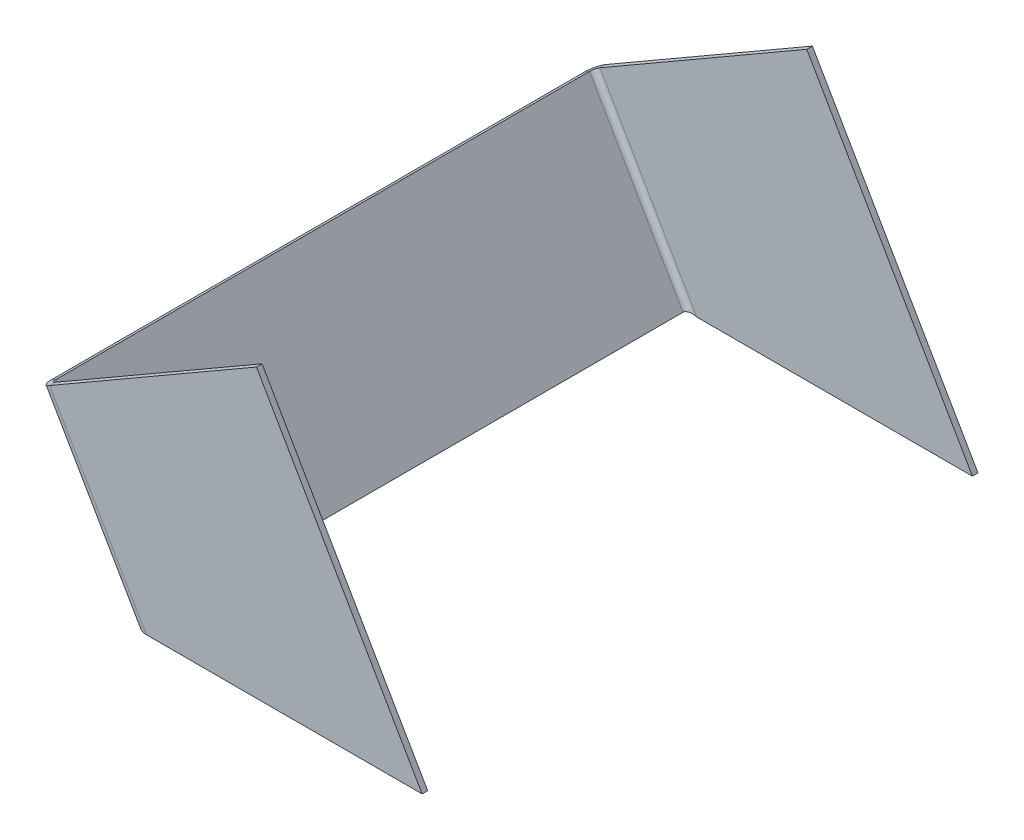
ISO-10303-21;
HEADER;
FILE_DESCRIPTION(('STEP AP214'),'2;1');
FILE_NAME('part.step','',(''),(''),'','','');
FILE_SCHEMA(('AUTOMOTIVE_DESIGN { 1 0 10303 214 1 1 1 1 }'));
ENDSEC;
DATA;
#1=APPLICATION_CONTEXT('core data for automotive mechanical design processes');
#2=APPLICATION_PROTOCOL_DEFINITION('international standard','automotive_design',2000,#1);
#3=PRODUCT_CONTEXT('',#1,'mechanical');
#4=PRODUCT('Part','Part','',(#3));
#5=PRODUCT_RELATED_PRODUCT_CATEGORY('part','',(#4));
#6=PRODUCT_DEFINITION_FORMATION('','',#4);
#7=PRODUCT_DEFINITION_CONTEXT('part definition',#1,'design');
#8=PRODUCT_DEFINITION('design','',#6,#7);
#9=PRODUCT_DEFINITION_SHAPE('','',#8);
#10=(LENGTH_UNIT() NAMED_UNIT(*) SI_UNIT(.MILLI.,.METRE.));
#11=(NAMED_UNIT(*) PLANE_ANGLE_UNIT() SI_UNIT($,.RADIAN.));
#12=(NAMED_UNIT(*) SI_UNIT($,.STERADIAN.) SOLID_ANGLE_UNIT());
#13=UNCERTAINTY_MEASURE_WITH_UNIT(LENGTH_MEASURE(1.E-05),#10,'distance_accuracy_value','');
#14=(GEOMETRIC_REPRESENTATION_CONTEXT(3) GLOBAL_UNCERTAINTY_ASSIGNED_CONTEXT((#13)) GLOBAL_UNIT_ASSIGNED_CONTEXT((#10,
#11,#12)) REPRESENTATION_CONTEXT('',''));
#15=CARTESIAN_POINT('',(0.,0.,0.));
#16=DIRECTION('',(0.,0.,1.));
#17=DIRECTION('',(1.,0.,0.));
#18=AXIS2_PLACEMENT_3D('',#15,#16,#17);
#19=CARTESIAN_POINT('',(-479.416697508023,3129.49491924311,-97.5));
#20=DIRECTION('',(0.866025403784441,0.499999999999996,0.));
#21=DIRECTION('',(-0.499999999999996,0.866025403784441,0.));
#22=AXIS2_PLACEMENT_3D('',#19,#20,#21);
#23=PLANE('',#22);
#24=DIRECTION('',(0.,0.,1.));
#25=VECTOR('',#24,1.);
#26=CARTESIAN_POINT('',(-520.122824862242,3199.99999999999,-97.5));
#27=LINE('',#26,#25);
#28=CARTESIAN_POINT('',(-520.122824862242,3199.99999999999,-99.5));
#29=VERTEX_POINT('',#28);
#30=CARTESIAN_POINT('',(-520.122824862242,3199.99999999999,-97.5));
#31=VERTEX_POINT('',#30);
#32=EDGE_CURVE('E11',#29,#31,#27,.T.);
#33=ORIENTED_EDGE('',*,*,#32,.F.);
#34=DIRECTION('',(-0.499999999999996,0.866025403784441,0.));
#35=VECTOR('',#34,1.);
#36=CARTESIAN_POINT('',(-479.416697508023,3129.49491924311,-99.5));
#37=LINE('',#36,#35);
#38=CARTESIAN_POINT('',(-579.416697508021,3302.7,-99.5));
#39=VERTEX_POINT('',#38);
#40=EDGE_CURVE('E134',#29,#39,#37,.T.);
#41=ORIENTED_EDGE('',*,*,#40,.T.);
#42=DIRECTION('',(0.,0.,1.));
#43=VECTOR('',#42,1.);
#44=CARTESIAN_POINT('',(-579.416697508021,3302.7,-97.5));
#45=LINE('',#44,#43);
#46=CARTESIAN_POINT('',(-579.416697508021,3302.7,-97.5));
#47=VERTEX_POINT('',#46);
#48=EDGE_CURVE('E50',#39,#47,#45,.T.);
#49=ORIENTED_EDGE('',*,*,#48,.T.);
#50=DIRECTION('',(-0.499999999999996,0.866025403784441,0.));
#51=VECTOR('',#50,1.);
#52=CARTESIAN_POINT('',(-479.416697508023,3129.49491924311,-97.5));
#53=LINE('',#52,#51);
#54=EDGE_CURVE('E195',#31,#47,#53,.T.);
#55=ORIENTED_EDGE('',*,*,#54,.F.);
#56=EDGE_LOOP('',(#33,#41,#49,#55));
#57=FACE_BOUND('',#56,.T.);
#58=ADVANCED_FACE('F40',(#57),#23,.T.);
#59=CARTESIAN_POINT('',(-579.416697508021,3302.7,-97.5));
#60=DIRECTION('',(-0.499999999999997,0.866025403784441,0.));
#61=DIRECTION('',(-0.866025403784441,-0.499999999999997,0.));
#62=AXIS2_PLACEMENT_3D('',#59,#60,#61);
#63=PLANE('',#62);
#64=ORIENTED_EDGE('',*,*,#48,.F.);
#65=DIRECTION('',(-0.866025403784441,-0.499999999999997,0.));
#66=VECTOR('',#65,1.);
#67=CARTESIAN_POINT('',(-579.416697508021,3302.7,-99.5));
#68=LINE('',#67,#66);
#69=CARTESIAN_POINT('',(-653.461869531591,3259.95,-99.5));
#70=VERTEX_POINT('',#69);
#71=EDGE_CURVE('E139',#39,#70,#68,.T.);
#72=ORIENTED_EDGE('',*,*,#71,.T.);
#73=DIRECTION('',(0.,0.,1.));
#74=VECTOR('',#73,1.);
#75=CARTESIAN_POINT('',(-653.461869531591,3259.95,-97.5));
#76=LINE('',#75,#74);
#77=CARTESIAN_POINT('',(-653.461869531591,3259.95,-97.5));
#78=VERTEX_POINT('',#77);
#79=EDGE_CURVE('E58',#70,#78,#76,.T.);
#80=ORIENTED_EDGE('',*,*,#79,.T.);
#81=DIRECTION('',(-0.866025403784441,-0.499999999999997,0.));
#82=VECTOR('',#81,1.);
#83=CARTESIAN_POINT('',(-579.416697508021,3302.7,-97.5));
#84=LINE('',#83,#82);
#85=EDGE_CURVE('E198',#47,#78,#84,.T.);
#86=ORIENTED_EDGE('',*,*,#85,.F.);
#87=EDGE_LOOP('',(#64,#72,#80,#86));
#88=FACE_BOUND('',#87,.T.);
#89=ADVANCED_FACE('F201',(#88),#63,.T.);
#90=CARTESIAN_POINT('',(-653.461869531591,3259.95,-95.5));
#91=DIRECTION('',(-0.499999999999997,0.866025403784441,0.));
#92=DIRECTION('',(-0.866025403784441,-0.499999999999997,0.));
#93=AXIS2_PLACEMENT_3D('',#90,#91,#92);
#94=PLANE('',#93);
#95=ORIENTED_EDGE('',*,*,#79,.F.);
#96=CARTESIAN_POINT('',(-653.461869531591,3259.95,-95.5));
#97=DIRECTION('',(-0.499999999999996,0.866025403784441,0.));
#98=DIRECTION('',(-0.866025403784441,-0.499999999999996,0.));
#99=AXIS2_PLACEMENT_3D('',#96,#97,#98);
#100=CIRCLE('',#99,4.);
#101=CARTESIAN_POINT('',(-656.925971146729,3257.95,-95.5));
#102=VERTEX_POINT('',#101);
#103=EDGE_CURVE('E128',#70,#102,#100,.T.);
#104=ORIENTED_EDGE('',*,*,#103,.T.);
#105=DIRECTION('',(0.866025403784441,0.499999999999996,0.));
#106=VECTOR('',#105,1.);
#107=CARTESIAN_POINT('',(-655.193920339161,3258.95,-95.5));
#108=LINE('',#107,#106);
#109=CARTESIAN_POINT('',(-655.193920339161,3258.95,-95.5));
#110=VERTEX_POINT('',#109);
#111=EDGE_CURVE('E190',#102,#110,#108,.T.);
#112=ORIENTED_EDGE('',*,*,#111,.T.);
#113=CARTESIAN_POINT('',(-653.461869531591,3259.95,-95.5));
#114=DIRECTION('',(0.499999999999997,-0.866025403784441,0.));
#115=DIRECTION('',(-0.866025403784441,-0.499999999999997,0.));
#116=AXIS2_PLACEMENT_3D('',#113,#114,#115);
#117=CIRCLE('',#116,2.);
#118=EDGE_CURVE('E117',#78,#110,#117,.F.);
#119=ORIENTED_EDGE('',*,*,#118,.F.);
#120=EDGE_LOOP('',(#95,#104,#112,#119));
#121=FACE_BOUND('',#120,.T.);
#122=ADVANCED_FACE('F230',(#121),#94,.T.);
#123=CARTESIAN_POINT('',(-655.193920339161,3258.95,-99.5));
#124=DIRECTION('',(0.499999999999996,-0.866025403784441,0.));
#125=DIRECTION('',(0.,0.,-1.));
#126=AXIS2_PLACEMENT_3D('',#123,#124,#125);
#127=PLANE('',#126);
#128=ORIENTED_EDGE('',*,*,#111,.F.);
#129=DIRECTION('',(0.,0.,-1.));
#130=VECTOR('',#129,1.);
#131=CARTESIAN_POINT('',(-656.925971146729,3257.95,-99.5));
#132=LINE('',#131,#130);
#133=CARTESIAN_POINT('',(-656.925971146729,3257.95,95.5));
#134=VERTEX_POINT('',#133);
#135=EDGE_CURVE('E156',#102,#134,#132,.F.);
#136=ORIENTED_EDGE('',*,*,#135,.T.);
#137=DIRECTION('',(0.86602540378443,0.500000000000015,0.));
#138=VECTOR('',#137,1.);
#139=CARTESIAN_POINT('',(-655.193920339161,3258.95,95.5));
#140=LINE('',#139,#138);
#141=CARTESIAN_POINT('',(-655.193920339161,3258.95,95.5));
#142=VERTEX_POINT('',#141);
#143=EDGE_CURVE('E187',#134,#142,#140,.T.);
#144=ORIENTED_EDGE('',*,*,#143,.T.);
#145=DIRECTION('',(0.,0.,-1.));
#146=VECTOR('',#145,1.);
#147=CARTESIAN_POINT('',(-655.193920339161,3258.95,-99.5));
#148=LINE('',#147,#146);
#149=EDGE_CURVE('E228',#110,#142,#148,.F.);
#150=ORIENTED_EDGE('',*,*,#149,.F.);
#151=EDGE_LOOP('',(#128,#136,#144,#150));
#152=FACE_BOUND('',#151,.T.);
#153=ADVANCED_FACE('F223',(#152),#127,.F.);
#154=CARTESIAN_POINT('',(-653.461869531591,3259.95,95.5));
#155=DIRECTION('',(-0.499999999999997,0.866025403784441,0.));
#156=DIRECTION('',(-0.866025403784441,-0.499999999999997,0.));
#157=AXIS2_PLACEMENT_3D('',#154,#155,#156);
#158=PLANE('',#157);
#159=ORIENTED_EDGE('',*,*,#143,.F.);
#160=CARTESIAN_POINT('',(-653.461869531591,3259.95,95.5));
#161=DIRECTION('',(-0.499999999999996,0.866025403784441,0.));
#162=DIRECTION('',(-0.866025403784441,-0.499999999999996,0.));
#163=AXIS2_PLACEMENT_3D('',#160,#161,#162);
#164=CIRCLE('',#163,4.);
#165=CARTESIAN_POINT('',(-653.461869531591,3259.95,99.5));
#166=VERTEX_POINT('',#165);
#167=EDGE_CURVE('E131',#134,#166,#164,.T.);
#168=ORIENTED_EDGE('',*,*,#167,.T.);
#169=DIRECTION('',(0.,0.,-1.));
#170=VECTOR('',#169,1.);
#171=CARTESIAN_POINT('',(-653.461869531591,3259.95,97.5));
#172=LINE('',#171,#170);
#173=CARTESIAN_POINT('',(-653.461869531591,3259.95,97.5));
#174=VERTEX_POINT('',#173);
#175=EDGE_CURVE('E184',#166,#174,#172,.T.);
#176=ORIENTED_EDGE('',*,*,#175,.T.);
#177=CARTESIAN_POINT('',(-653.461869531591,3259.95,95.5));
#178=DIRECTION('',(0.499999999999997,-0.866025403784441,0.));
#179=DIRECTION('',(-0.866025403784441,-0.499999999999997,0.));
#180=AXIS2_PLACEMENT_3D('',#177,#178,#179);
#181=CIRCLE('',#180,2.);
#182=EDGE_CURVE('E282',#142,#174,#181,.F.);
#183=ORIENTED_EDGE('',*,*,#182,.F.);
#184=EDGE_LOOP('',(#159,#168,#176,#183));
#185=FACE_BOUND('',#184,.T.);
#186=ADVANCED_FACE('F324',(#185),#158,.T.);
#187=CARTESIAN_POINT('',(-656.925971146729,3257.95,97.5));
#188=DIRECTION('',(0.499999999999997,-0.866025403784441,0.));
#189=DIRECTION('',(-0.866025403784441,-0.499999999999997,0.));
#190=AXIS2_PLACEMENT_3D('',#187,#188,#189);
#191=PLANE('',#190);
#192=ORIENTED_EDGE('',*,*,#175,.F.);
#193=DIRECTION('',(-0.866025403784441,-0.499999999999997,0.));
#194=VECTOR('',#193,1.);
#195=CARTESIAN_POINT('',(-656.925971146729,3257.95,99.5));
#196=LINE('',#195,#194);
#197=CARTESIAN_POINT('',(-579.416697508021,3302.7,99.5));
#198=VERTEX_POINT('',#197);
#199=EDGE_CURVE('E163',#166,#198,#196,.F.);
#200=ORIENTED_EDGE('',*,*,#199,.T.);
#201=DIRECTION('',(0.,0.,-1.));
#202=VECTOR('',#201,1.);
#203=CARTESIAN_POINT('',(-579.416697508021,3302.7,97.5));
#204=LINE('',#203,#202);
#205=CARTESIAN_POINT('',(-579.416697508021,3302.7,97.5));
#206=VERTEX_POINT('',#205);
#207=EDGE_CURVE('E181',#198,#206,#204,.T.);
#208=ORIENTED_EDGE('',*,*,#207,.T.);
#209=DIRECTION('',(-0.866025403784441,-0.499999999999997,0.));
#210=VECTOR('',#209,1.);
#211=CARTESIAN_POINT('',(-656.925971146729,3257.95,97.5));
#212=LINE('',#211,#210);
#213=EDGE_CURVE('E262',#174,#206,#212,.F.);
#214=ORIENTED_EDGE('',*,*,#213,.F.);
#215=EDGE_LOOP('',(#192,#200,#208,#214));
#216=FACE_BOUND('',#215,.T.);
#217=ADVANCED_FACE('F303',(#216),#191,.F.);
#218=CARTESIAN_POINT('',(-479.416697508023,3129.49491924311,97.5));
#219=DIRECTION('',(-0.866025403784441,-0.499999999999996,0.));
#220=DIRECTION('',(-0.499999999999996,0.866025403784441,0.));
#221=AXIS2_PLACEMENT_3D('',#218,#219,#220);
#222=PLANE('',#221);
#223=ORIENTED_EDGE('',*,*,#207,.F.);
#224=DIRECTION('',(-0.499999999999996,0.866025403784441,0.));
#225=VECTOR('',#224,1.);
#226=CARTESIAN_POINT('',(-479.416697508023,3129.49491924311,99.5));
#227=LINE('',#226,#225);
#228=CARTESIAN_POINT('',(-520.122824862242,3199.99999999999,99.5));
#229=VERTEX_POINT('',#228);
#230=EDGE_CURVE('E160',#229,#198,#227,.T.);
#231=ORIENTED_EDGE('',*,*,#230,.F.);
#232=DIRECTION('',(0.,0.,-1.));
#233=VECTOR('',#232,1.);
#234=CARTESIAN_POINT('',(-520.122824862242,3199.99999999999,97.5));
#235=LINE('',#234,#233);
#236=CARTESIAN_POINT('',(-520.122824862242,3199.99999999999,97.5));
#237=VERTEX_POINT('',#236);
#238=EDGE_CURVE('E178',#229,#237,#235,.T.);
#239=ORIENTED_EDGE('',*,*,#238,.T.);
#240=DIRECTION('',(-0.499999999999996,0.866025403784441,0.));
#241=VECTOR('',#240,1.);
#242=CARTESIAN_POINT('',(-479.416697508023,3129.49491924311,97.5));
#243=LINE('',#242,#241);
#244=EDGE_CURVE('E141',#237,#206,#243,.T.);
#245=ORIENTED_EDGE('',*,*,#244,.T.);
#246=EDGE_LOOP('',(#223,#231,#239,#245));
#247=FACE_BOUND('',#246,.T.);
#248=ADVANCED_FACE('F250',(#247),#222,.F.);
#249=CARTESIAN_POINT('',(-637.996865734336,3199.99999999999,97.5));
#250=DIRECTION('',(0.,-1.,0.));
#251=DIRECTION('',(-1.,0.,0.));
#252=AXIS2_PLACEMENT_3D('',#249,#250,#251);
#253=PLANE('',#252);
#254=ORIENTED_EDGE('',*,*,#238,.F.);
#255=DIRECTION('',(-1.,0.,0.));
#256=VECTOR('',#255,1.);
#257=CARTESIAN_POINT('',(-637.996865734336,3199.99999999999,99.5));
#258=LINE('',#257,#256);
#259=CARTESIAN_POINT('',(-618.849720893668,3199.99999999999,99.5));
#260=VERTEX_POINT('',#259);
#261=EDGE_CURVE('E157',#229,#260,#258,.T.);
#262=ORIENTED_EDGE('',*,*,#261,.T.);
#263=DIRECTION('',(0.,0.,-1.));
#264=VECTOR('',#263,1.);
#265=CARTESIAN_POINT('',(-618.849720893668,3199.99999999999,97.5));
#266=LINE('',#265,#264);
#267=CARTESIAN_POINT('',(-618.849720893668,3199.99999999999,97.5));
#268=VERTEX_POINT('',#267);
#269=EDGE_CURVE('E175',#260,#268,#266,.T.);
#270=ORIENTED_EDGE('',*,*,#269,.T.);
#271=DIRECTION('',(-1.,0.,0.));
#272=VECTOR('',#271,1.);
#273=CARTESIAN_POINT('',(-637.996865734336,3199.99999999999,97.5));
#274=LINE('',#273,#272);
#275=EDGE_CURVE('E259',#237,#268,#274,.T.);
#276=ORIENTED_EDGE('',*,*,#275,.F.);
#277=EDGE_LOOP('',(#254,#262,#270,#276));
#278=FACE_BOUND('',#277,.T.);
#279=ADVANCED_FACE('F264',(#278),#253,.T.);
#280=CARTESIAN_POINT('',(-621.736472239616,3200.99999999999,95.5));
#281=CARTESIAN_POINT('',(-622.313822508806,3200.66666666666,95.5));
#282=CARTESIAN_POINT('',(-622.891172777995,3200.33333333332,95.5));
#283=CARTESIAN_POINT('',(-623.468523047185,3199.99999999999,95.5));
#284=CARTESIAN_POINT('',(-621.736472239616,3200.99999999999,99.5));
#285=CARTESIAN_POINT('',(-622.313822508806,3200.66666666666,100.833333333333));
#286=CARTESIAN_POINT('',(-622.891172777995,3200.33333333333,102.166666666667));
#287=CARTESIAN_POINT('',(-623.468523047185,3199.99999999999,103.5));
#288=CARTESIAN_POINT('',(-615.96296954772,3198.99999999999,99.5));
#289=CARTESIAN_POINT('',(-615.38561927853,3199.33333333333,100.833333333333));
#290=CARTESIAN_POINT('',(-614.808269009341,3199.66666666666,102.166666666667));
#291=CARTESIAN_POINT('',(-614.230918740151,3199.99999999999,103.5));
#292=CARTESIAN_POINT('',(-615.96296954772,3198.99999999999,95.5));
#293=CARTESIAN_POINT('',(-615.38561927853,3199.33333333332,95.5));
#294=CARTESIAN_POINT('',(-614.808269009341,3199.66666666666,95.5));
#295=CARTESIAN_POINT('',(-614.230918740151,3199.99999999999,95.5));
#296=CARTESIAN_POINT('',(-615.96296954772,3198.99999999999,91.5));
#297=CARTESIAN_POINT('',(-615.38561927853,3199.33333333333,90.1666666666667));
#298=CARTESIAN_POINT('',(-614.808269009341,3199.66666666666,88.8333333333334));
#299=CARTESIAN_POINT('',(-614.230918740151,3199.99999999999,87.5));
#300=CARTESIAN_POINT('',(-621.736472239616,3200.99999999999,91.5));
#301=CARTESIAN_POINT('',(-622.313822508806,3200.66666666666,90.1666666666667));
#302=CARTESIAN_POINT('',(-622.891172777995,3200.33333333333,88.8333333333334));
#303=CARTESIAN_POINT('',(-623.468523047185,3199.99999999999,87.5));
#304=CARTESIAN_POINT('',(-621.736472239616,3200.99999999999,95.5));
#305=CARTESIAN_POINT('',(-622.313822508806,3200.66666666666,95.5));
#306=CARTESIAN_POINT('',(-622.891172777995,3200.33333333332,95.5));
#307=CARTESIAN_POINT('',(-623.468523047185,3199.99999999999,95.5));
#308=(BOUNDED_SURFACE() B_SPLINE_SURFACE(3,3,((#280,#281,#282,#283),(#284,#285,#286,#287),(#288,
#289,#290,#291),(#292,#293,#294,#295),(#296,#297,#298,#299),(#300,#301,#302,#303),(#304,#305,
#306,#307)),.UNSPECIFIED.,.T.,.F.,.F.) B_SPLINE_SURFACE_WITH_KNOTS((4,3,4),(4,4),(0.,0.5,1.),
(0.,1.),.UNSPECIFIED.) GEOMETRIC_REPRESENTATION_ITEM() RATIONAL_B_SPLINE_SURFACE(((1.,1.,1.,1.),
(0.333333333333333,0.333333333333333,0.333333333333333,0.333333333333333),(0.333333333333333,
0.333333333333333,0.333333333333333,0.333333333333333),(1.,1.,1.,1.),(0.333333333333333,
0.333333333333333,0.333333333333333,0.333333333333333),(0.333333333333333,0.333333333333333,
0.333333333333333,0.333333333333333),(1.,1.,1.,1.))) REPRESENTATION_ITEM('') SURFACE());
#309=CARTESIAN_POINT('',(-618.849720893668,3199.99999999999,95.5));
#310=DIRECTION('',(0.,1.,0.));
#311=DIRECTION('',(-1.,0.,0.));
#312=AXIS2_PLACEMENT_3D('',#309,#310,#311);
#313=ELLIPSE('',#312,4.61880215351707,4.);
#314=CARTESIAN_POINT('',(-623.468523047185,3199.99999999999,95.5000000000001));
#315=VERTEX_POINT('',#314);
#316=EDGE_CURVE('E153',#315,#260,#313,.T.);
#317=DIRECTION('',(0.866025403784441,0.499999999999996,0.));
#318=VECTOR('',#317,1.);
#319=CARTESIAN_POINT('',(-621.736472239616,3200.99999999999,95.5));
#320=LINE('',#319,#318);
#321=CARTESIAN_POINT('',(-621.736472239616,3200.99999999999,95.5));
#322=VERTEX_POINT('',#321);
#323=EDGE_CURVE('E172',#315,#322,#320,.T.);
#324=CARTESIAN_POINT('',(-618.849720893668,3199.99999999999,95.5));
#325=DIRECTION('',(0.327326835353962,0.944911182523077,0.));
#326=DIRECTION('',(-0.944911182523077,0.327326835353962,0.));
#327=AXIS2_PLACEMENT_3D('',#324,#325,#326);
#328=ELLIPSE('',#327,3.0550504633038,2.);
#329=EDGE_CURVE('E280',#322,#268,#328,.T.);
#330=ORIENTED_EDGE('',*,*,#269,.F.);
#331=ORIENTED_EDGE('',*,*,#316,.F.);
#332=ORIENTED_EDGE('',*,*,#323,.T.);
#333=ORIENTED_EDGE('',*,*,#329,.T.);
#334=EDGE_LOOP('',(#330,#331,#332,#333));
#335=FACE_BOUND('',#334,.T.);
#336=ADVANCED_FACE('F298',(#335),#308,.T.);
#337=CARTESIAN_POINT('',(-621.736472239616,3200.99999999999,-99.5));
#338=DIRECTION('',(0.499999999999996,-0.866025403784441,0.));
#339=DIRECTION('',(0.,0.,-1.));
#340=AXIS2_PLACEMENT_3D('',#337,#338,#339);
#341=PLANE('',#340);
#342=ORIENTED_EDGE('',*,*,#323,.F.);
#343=DIRECTION('',(0.,0.,-1.));
#344=VECTOR('',#343,1.);
#345=CARTESIAN_POINT('',(-623.468523047185,3199.99999999999,-99.5));
#346=LINE('',#345,#344);
#347=CARTESIAN_POINT('',(-623.468523047185,3199.99999999999,-95.5));
#348=VERTEX_POINT('',#347);
#349=EDGE_CURVE('E148',#348,#315,#346,.F.);
#350=ORIENTED_EDGE('',*,*,#349,.F.);
#351=DIRECTION('',(0.86602540378443,0.500000000000015,0.));
#352=VECTOR('',#351,1.);
#353=CARTESIAN_POINT('',(-621.736472239616,3200.99999999999,-95.5));
#354=LINE('',#353,#352);
#355=CARTESIAN_POINT('',(-621.736472239616,3200.99999999999,-95.5));
#356=VERTEX_POINT('',#355);
#357=EDGE_CURVE('E116',#348,#356,#354,.T.);
#358=ORIENTED_EDGE('',*,*,#357,.T.);
#359=DIRECTION('',(0.,0.,-1.));
#360=VECTOR('',#359,1.);
#361=CARTESIAN_POINT('',(-621.736472239616,3200.99999999999,-99.5));
#362=LINE('',#361,#360);
#363=EDGE_CURVE('E273',#356,#322,#362,.F.);
#364=ORIENTED_EDGE('',*,*,#363,.T.);
#365=EDGE_LOOP('',(#342,#350,#358,#364));
#366=FACE_BOUND('',#365,.T.);
#367=ADVANCED_FACE('F295',(#366),#341,.T.);
#368=CARTESIAN_POINT('',(-621.736472239616,3200.99999999999,-95.5));
#369=CARTESIAN_POINT('',(-622.313822508806,3200.66666666666,-95.5));
#370=CARTESIAN_POINT('',(-622.891172777995,3200.33333333332,-95.5));
#371=CARTESIAN_POINT('',(-623.468523047185,3199.99999999999,-95.5));
#372=CARTESIAN_POINT('',(-621.736472239616,3200.99999999999,-91.5));
#373=CARTESIAN_POINT('',(-622.313822508806,3200.66666666666,-90.1666666666667));
#374=CARTESIAN_POINT('',(-622.891172777995,3200.33333333333,-88.8333333333334));
#375=CARTESIAN_POINT('',(-623.468523047185,3199.99999999999,-87.5));
#376=CARTESIAN_POINT('',(-615.96296954772,3198.99999999999,-91.5));
#377=CARTESIAN_POINT('',(-615.38561927853,3199.33333333333,-90.1666666666667));
#378=CARTESIAN_POINT('',(-614.808269009341,3199.66666666666,-88.8333333333334));
#379=CARTESIAN_POINT('',(-614.230918740151,3199.99999999999,-87.5));
#380=CARTESIAN_POINT('',(-615.96296954772,3198.99999999999,-95.5));
#381=CARTESIAN_POINT('',(-615.38561927853,3199.33333333332,-95.5));
#382=CARTESIAN_POINT('',(-614.808269009341,3199.66666666666,-95.5));
#383=CARTESIAN_POINT('',(-614.230918740151,3199.99999999999,-95.5));
#384=CARTESIAN_POINT('',(-615.96296954772,3198.99999999999,-99.5));
#385=CARTESIAN_POINT('',(-615.38561927853,3199.33333333333,-100.833333333333));
#386=CARTESIAN_POINT('',(-614.808269009341,3199.66666666666,-102.166666666667));
#387=CARTESIAN_POINT('',(-614.230918740151,3199.99999999999,-103.5));
#388=CARTESIAN_POINT('',(-621.736472239616,3200.99999999999,-99.5));
#389=CARTESIAN_POINT('',(-622.313822508806,3200.66666666666,-100.833333333333));
#390=CARTESIAN_POINT('',(-622.891172777995,3200.33333333333,-102.166666666667));
#391=CARTESIAN_POINT('',(-623.468523047185,3199.99999999999,-103.5));
#392=CARTESIAN_POINT('',(-621.736472239616,3200.99999999999,-95.5));
#393=CARTESIAN_POINT('',(-622.313822508806,3200.66666666666,-95.5));
#394=CARTESIAN_POINT('',(-622.891172777995,3200.33333333332,-95.5));
#395=CARTESIAN_POINT('',(-623.468523047185,3199.99999999999,-95.5));
#396=(BOUNDED_SURFACE() B_SPLINE_SURFACE(3,3,((#368,#369,#370,#371),(#372,#373,#374,#375),(#376,
#377,#378,#379),(#380,#381,#382,#383),(#384,#385,#386,#387),(#388,#389,#390,#391),(#392,#393,
#394,#395)),.UNSPECIFIED.,.T.,.F.,.F.) B_SPLINE_SURFACE_WITH_KNOTS((4,3,4),(4,4),(0.,0.5,1.),
(0.,1.),.UNSPECIFIED.) GEOMETRIC_REPRESENTATION_ITEM() RATIONAL_B_SPLINE_SURFACE(((1.,1.,1.,1.),
(0.333333333333333,0.333333333333333,0.333333333333333,0.333333333333333),(0.333333333333333,
0.333333333333333,0.333333333333333,0.333333333333333),(1.,1.,1.,1.),(0.333333333333333,
0.333333333333333,0.333333333333333,0.333333333333333),(0.333333333333333,0.333333333333333,
0.333333333333333,0.333333333333333),(1.,1.,1.,1.))) REPRESENTATION_ITEM('') SURFACE());
#397=CARTESIAN_POINT('',(-618.849720893668,3199.99999999999,-95.5));
#398=DIRECTION('',(0.,1.,0.));
#399=DIRECTION('',(-1.,0.,0.));
#400=AXIS2_PLACEMENT_3D('',#397,#398,#399);
#401=ELLIPSE('',#400,4.61880215351707,4.);
#402=CARTESIAN_POINT('',(-618.849720893668,3199.99999999999,-99.5));
#403=VERTEX_POINT('',#402);
#404=EDGE_CURVE('E125',#403,#348,#401,.T.);
#405=DIRECTION('',(0.,0.,1.));
#406=VECTOR('',#405,1.);
#407=CARTESIAN_POINT('',(-618.849720893668,3199.99999999999,-97.5));
#408=LINE('',#407,#406);
#409=CARTESIAN_POINT('',(-618.849720893668,3199.99999999999,-97.5));
#410=VERTEX_POINT('',#409);
#411=EDGE_CURVE('E44',#403,#410,#408,.T.);
#412=CARTESIAN_POINT('',(-618.849720893668,3199.99999999999,-95.5));
#413=DIRECTION('',(0.327326835353962,0.944911182523077,0.));
#414=DIRECTION('',(-0.944911182523077,0.327326835353962,0.));
#415=AXIS2_PLACEMENT_3D('',#412,#413,#414);
#416=ELLIPSE('',#415,3.0550504633038,2.);
#417=EDGE_CURVE('E202',#410,#356,#416,.T.);
#418=ORIENTED_EDGE('',*,*,#357,.F.);
#419=ORIENTED_EDGE('',*,*,#404,.F.);
#420=ORIENTED_EDGE('',*,*,#411,.T.);
#421=ORIENTED_EDGE('',*,*,#417,.T.);
#422=EDGE_LOOP('',(#418,#419,#420,#421));
#423=FACE_BOUND('',#422,.T.);
#424=ADVANCED_FACE('F136',(#423),#396,.T.);
#425=CARTESIAN_POINT('',(-479.416697508023,3199.99999999999,-97.5));
#426=DIRECTION('',(0.,1.,0.));
#427=DIRECTION('',(-1.,0.,0.));
#428=AXIS2_PLACEMENT_3D('',#425,#426,#427);
#429=PLANE('',#428);
#430=DIRECTION('',(-1.,0.,0.));
#431=VECTOR('',#430,1.);
#432=CARTESIAN_POINT('',(-479.416697508023,3199.99999999999,-99.5));
#433=LINE('',#432,#431);
#434=EDGE_CURVE('E107',#29,#403,#433,.T.);
#435=ORIENTED_EDGE('',*,*,#434,.F.);
#436=ORIENTED_EDGE('',*,*,#32,.T.);
#437=DIRECTION('',(-1.,0.,0.));
#438=VECTOR('',#437,1.);
#439=CARTESIAN_POINT('',(-479.416697508023,3199.99999999999,-97.5));
#440=LINE('',#439,#438);
#441=EDGE_CURVE('E110',#31,#410,#440,.T.);
#442=ORIENTED_EDGE('',*,*,#441,.T.);
#443=ORIENTED_EDGE('',*,*,#411,.F.);
#444=EDGE_LOOP('',(#435,#436,#442,#443));
#445=FACE_BOUND('',#444,.T.);
#446=ADVANCED_FACE('F42',(#445),#429,.F.);
#447=CARTESIAN_POINT('',(-553.461869531592,3086.74491924311,-95.5));
#448=DIRECTION('',(-0.499999999999996,0.866025403784441,0.));
#449=DIRECTION('',(0.866025403784441,0.499999999999996,0.));
#450=AXIS2_PLACEMENT_3D('',#447,#448,#449);
#451=CYLINDRICAL_SURFACE('',#450,2.);
#452=DIRECTION('',(-0.499999999999996,0.866025403784441,0.));
#453=VECTOR('',#452,1.);
#454=CARTESIAN_POINT('',(-555.193920339161,3085.74491924311,-95.5));
#455=LINE('',#454,#453);
#456=EDGE_CURVE('E276',#356,#110,#455,.T.);
#457=ORIENTED_EDGE('',*,*,#456,.F.);
#458=ORIENTED_EDGE('',*,*,#417,.F.);
#459=DIRECTION('',(-0.499999999999996,0.866025403784441,0.));
#460=VECTOR('',#459,1.);
#461=CARTESIAN_POINT('',(-553.461869531592,3086.74491924311,-97.5));
#462=LINE('',#461,#460);
#463=EDGE_CURVE('E285',#410,#78,#462,.T.);
#464=ORIENTED_EDGE('',*,*,#463,.T.);
#465=ORIENTED_EDGE('',*,*,#118,.T.);
#466=EDGE_LOOP('',(#457,#458,#464,#465));
#467=FACE_BOUND('',#466,.T.);
#468=ADVANCED_FACE('F288',(#467),#451,.F.);
#469=CARTESIAN_POINT('',(-479.416697508023,3129.49491924311,-97.5));
#470=DIRECTION('',(0.,0.,1.));
#471=DIRECTION('',(-0.500000000000007,-0.866025403784435,0.));
#472=AXIS2_PLACEMENT_3D('',#469,#470,#471);
#473=PLANE('',#472);
#474=ORIENTED_EDGE('',*,*,#463,.F.);
#475=ORIENTED_EDGE('',*,*,#441,.F.);
#476=ORIENTED_EDGE('',*,*,#54,.T.);
#477=ORIENTED_EDGE('',*,*,#85,.T.);
#478=EDGE_LOOP('',(#474,#475,#476,#477));
#479=FACE_BOUND('',#478,.T.);
#480=ADVANCED_FACE('F197',(#479),#473,.T.);
#481=CARTESIAN_POINT('',(-553.461869531592,3086.74491924311,95.5));
#482=DIRECTION('',(-0.499999999999996,0.866025403784441,0.));
#483=DIRECTION('',(0.866025403784441,0.499999999999996,0.));
#484=AXIS2_PLACEMENT_3D('',#481,#482,#483);
#485=CYLINDRICAL_SURFACE('',#484,2.);
#486=DIRECTION('',(-0.499999999999996,0.866025403784441,0.));
#487=VECTOR('',#486,1.);
#488=CARTESIAN_POINT('',(-553.461869531592,3086.74491924311,97.5));
#489=LINE('',#488,#487);
#490=EDGE_CURVE('E265',#268,#174,#489,.T.);
#491=ORIENTED_EDGE('',*,*,#490,.F.);
#492=ORIENTED_EDGE('',*,*,#329,.F.);
#493=DIRECTION('',(-0.499999999999996,0.866025403784441,0.));
#494=VECTOR('',#493,1.);
#495=CARTESIAN_POINT('',(-555.193920339161,3085.74491924311,95.5));
#496=LINE('',#495,#494);
#497=EDGE_CURVE('E270',#322,#142,#496,.T.);
#498=ORIENTED_EDGE('',*,*,#497,.T.);
#499=ORIENTED_EDGE('',*,*,#182,.T.);
#500=EDGE_LOOP('',(#491,#492,#498,#499));
#501=FACE_BOUND('',#500,.T.);
#502=ADVANCED_FACE('F301',(#501),#485,.F.);
#503=CARTESIAN_POINT('',(-555.193920339161,3085.74491924311,-99.5));
#504=DIRECTION('',(0.866025403784441,0.499999999999996,0.));
#505=DIRECTION('',(0.499999999999996,-0.866025403784441,0.));
#506=AXIS2_PLACEMENT_3D('',#503,#504,#505);
#507=PLANE('',#506);
#508=ORIENTED_EDGE('',*,*,#497,.F.);
#509=ORIENTED_EDGE('',*,*,#363,.F.);
#510=ORIENTED_EDGE('',*,*,#456,.T.);
#511=ORIENTED_EDGE('',*,*,#149,.T.);
#512=EDGE_LOOP('',(#508,#509,#510,#511));
#513=FACE_BOUND('',#512,.T.);
#514=ADVANCED_FACE('F292',(#513),#507,.T.);
#515=CARTESIAN_POINT('',(-556.92597114673,3084.74491924311,97.5));
#516=DIRECTION('',(0.,0.,-1.));
#517=DIRECTION('',(0.500000000000007,0.866025403784435,0.));
#518=AXIS2_PLACEMENT_3D('',#515,#516,#517);
#519=PLANE('',#518);
#520=ORIENTED_EDGE('',*,*,#244,.F.);
#521=ORIENTED_EDGE('',*,*,#275,.T.);
#522=ORIENTED_EDGE('',*,*,#490,.T.);
#523=ORIENTED_EDGE('',*,*,#213,.T.);
#524=EDGE_LOOP('',(#520,#521,#522,#523));
#525=FACE_BOUND('',#524,.T.);
#526=ADVANCED_FACE('F257',(#525),#519,.T.);
#527=CARTESIAN_POINT('',(-553.461869531592,3086.74491924311,-95.5));
#528=DIRECTION('',(-0.499999999999996,0.866025403784441,0.));
#529=DIRECTION('',(0.866025403784441,0.499999999999996,0.));
#530=AXIS2_PLACEMENT_3D('',#527,#528,#529);
#531=CYLINDRICAL_SURFACE('',#530,4.);
#532=DIRECTION('',(0.499999999999996,-0.866025403784441,0.));
#533=VECTOR('',#532,1.);
#534=CARTESIAN_POINT('',(-556.92597114673,3084.74491924311,-95.5));
#535=LINE('',#534,#533);
#536=EDGE_CURVE('E151',#348,#102,#535,.F.);
#537=ORIENTED_EDGE('',*,*,#536,.T.);
#538=ORIENTED_EDGE('',*,*,#103,.F.);
#539=DIRECTION('',(-0.499999999999996,0.866025403784441,0.));
#540=VECTOR('',#539,1.);
#541=CARTESIAN_POINT('',(-553.461869531592,3086.74491924311,-99.5));
#542=LINE('',#541,#540);
#543=EDGE_CURVE('E122',#403,#70,#542,.T.);
#544=ORIENTED_EDGE('',*,*,#543,.F.);
#545=ORIENTED_EDGE('',*,*,#404,.T.);
#546=EDGE_LOOP('',(#537,#538,#544,#545));
#547=FACE_BOUND('',#546,.T.);
#548=ADVANCED_FACE('F124',(#547),#531,.T.);
#549=CARTESIAN_POINT('',(-479.416697508023,3129.49491924311,-99.5));
#550=DIRECTION('',(0.,0.,1.));
#551=DIRECTION('',(-0.500000000000007,-0.866025403784435,0.));
#552=AXIS2_PLACEMENT_3D('',#549,#550,#551);
#553=PLANE('',#552);
#554=ORIENTED_EDGE('',*,*,#543,.T.);
#555=ORIENTED_EDGE('',*,*,#71,.F.);
#556=ORIENTED_EDGE('',*,*,#40,.F.);
#557=ORIENTED_EDGE('',*,*,#434,.T.);
#558=EDGE_LOOP('',(#554,#555,#556,#557));
#559=FACE_BOUND('',#558,.T.);
#560=ADVANCED_FACE('F133',(#559),#553,.F.);
#561=CARTESIAN_POINT('',(-553.461869531592,3086.74491924311,95.5));
#562=DIRECTION('',(-0.499999999999996,0.866025403784441,0.));
#563=DIRECTION('',(0.866025403784441,0.499999999999996,0.));
#564=AXIS2_PLACEMENT_3D('',#561,#562,#563);
#565=CYLINDRICAL_SURFACE('',#564,4.);
#566=DIRECTION('',(-0.499999999999996,0.866025403784441,0.));
#567=VECTOR('',#566,1.);
#568=CARTESIAN_POINT('',(-553.461869531592,3086.74491924311,99.5));
#569=LINE('',#568,#567);
#570=EDGE_CURVE('E146',#260,#166,#569,.T.);
#571=ORIENTED_EDGE('',*,*,#570,.T.);
#572=ORIENTED_EDGE('',*,*,#167,.F.);
#573=DIRECTION('',(-0.499999999999996,0.866025403784441,0.));
#574=VECTOR('',#573,1.);
#575=CARTESIAN_POINT('',(-556.92597114673,3084.74491924311,95.5));
#576=LINE('',#575,#574);
#577=EDGE_CURVE('E152',#315,#134,#576,.T.);
#578=ORIENTED_EDGE('',*,*,#577,.F.);
#579=ORIENTED_EDGE('',*,*,#316,.T.);
#580=EDGE_LOOP('',(#571,#572,#578,#579));
#581=FACE_BOUND('',#580,.T.);
#582=ADVANCED_FACE('F218',(#581),#565,.T.);
#583=CARTESIAN_POINT('',(-556.92597114673,3084.74491924311,-99.5));
#584=DIRECTION('',(0.866025403784441,0.499999999999996,0.));
#585=DIRECTION('',(0.499999999999996,-0.866025403784441,0.));
#586=AXIS2_PLACEMENT_3D('',#583,#584,#585);
#587=PLANE('',#586);
#588=ORIENTED_EDGE('',*,*,#577,.T.);
#589=ORIENTED_EDGE('',*,*,#135,.F.);
#590=ORIENTED_EDGE('',*,*,#536,.F.);
#591=ORIENTED_EDGE('',*,*,#349,.T.);
#592=EDGE_LOOP('',(#588,#589,#590,#591));
#593=FACE_BOUND('',#592,.T.);
#594=ADVANCED_FACE('F214',(#593),#587,.F.);
#595=CARTESIAN_POINT('',(-556.92597114673,3084.74491924311,99.5));
#596=DIRECTION('',(0.,0.,-1.));
#597=DIRECTION('',(0.500000000000007,0.866025403784435,0.));
#598=AXIS2_PLACEMENT_3D('',#595,#596,#597);
#599=PLANE('',#598);
#600=ORIENTED_EDGE('',*,*,#230,.T.);
#601=ORIENTED_EDGE('',*,*,#199,.F.);
#602=ORIENTED_EDGE('',*,*,#570,.F.);
#603=ORIENTED_EDGE('',*,*,#261,.F.);
#604=EDGE_LOOP('',(#600,#601,#602,#603));
#605=FACE_BOUND('',#604,.T.);
#606=ADVANCED_FACE('F305',(#605),#599,.F.);
#607=CLOSED_SHELL('',(#58,#89,#122,#153,#186,#217,#248,#279,#336,#367,#424,#446,#468,#480,#502,
#514,#526,#548,#560,#582,#594,#606));
#608=MANIFOLD_SOLID_BREP('B2',#607);
#609=ADVANCED_BREP_SHAPE_REPRESENTATION('',(#18,#608),#14);
#610=SHAPE_DEFINITION_REPRESENTATION(#9,#609);
ENDSEC;
END-ISO-10303-21;
